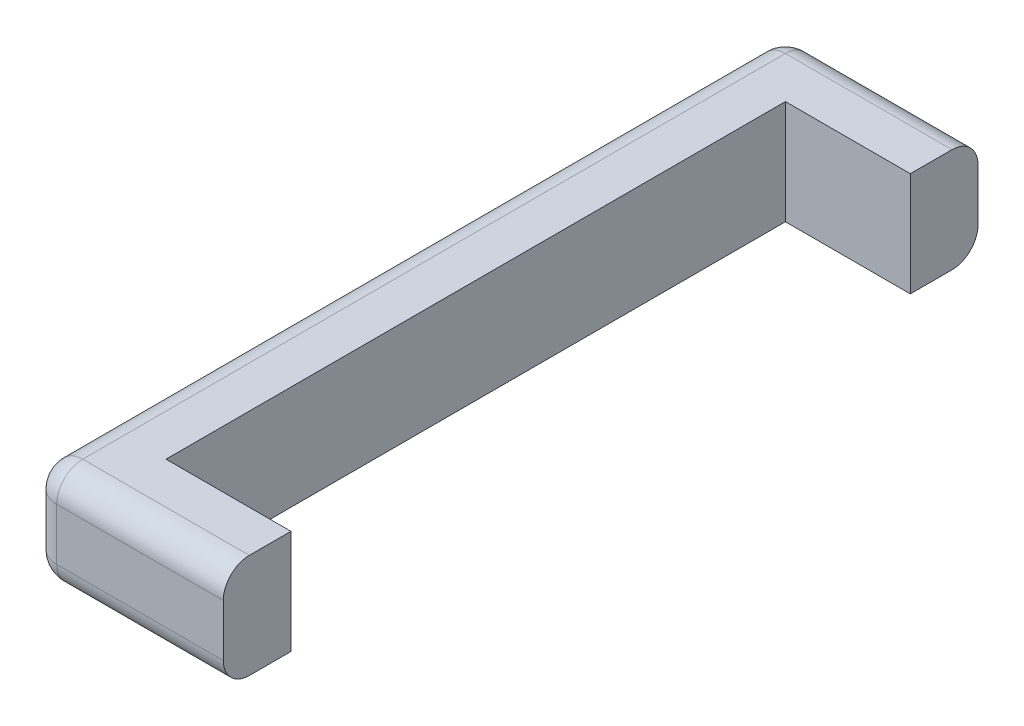
ISO-10303-21;
HEADER;
FILE_DESCRIPTION(('STEP AP214'),'2;1');
FILE_NAME('part.step','',(''),(''),'','','');
FILE_SCHEMA(('AUTOMOTIVE_DESIGN { 1 0 10303 214 1 1 1 1 }'));
ENDSEC;
DATA;
#1=APPLICATION_CONTEXT('core data for automotive mechanical design processes');
#2=APPLICATION_PROTOCOL_DEFINITION('international standard','automotive_design',2000,#1);
#3=PRODUCT_CONTEXT('',#1,'mechanical');
#4=PRODUCT('Part','Part','',(#3));
#5=PRODUCT_RELATED_PRODUCT_CATEGORY('part','',(#4));
#6=PRODUCT_DEFINITION_FORMATION('','',#4);
#7=PRODUCT_DEFINITION_CONTEXT('part definition',#1,'design');
#8=PRODUCT_DEFINITION('design','',#6,#7);
#9=PRODUCT_DEFINITION_SHAPE('','',#8);
#10=(LENGTH_UNIT() NAMED_UNIT(*) SI_UNIT(.MILLI.,.METRE.));
#11=(NAMED_UNIT(*) PLANE_ANGLE_UNIT() SI_UNIT($,.RADIAN.));
#12=(NAMED_UNIT(*) SI_UNIT($,.STERADIAN.) SOLID_ANGLE_UNIT());
#13=UNCERTAINTY_MEASURE_WITH_UNIT(LENGTH_MEASURE(1.E-05),#10,'distance_accuracy_value','');
#14=(GEOMETRIC_REPRESENTATION_CONTEXT(3) GLOBAL_UNCERTAINTY_ASSIGNED_CONTEXT((#13)) GLOBAL_UNIT_ASSIGNED_CONTEXT((#10,
#11,#12)) REPRESENTATION_CONTEXT('',''));
#15=CARTESIAN_POINT('',(0.,0.,0.));
#16=DIRECTION('',(0.,0.,1.));
#17=DIRECTION('',(1.,0.,0.));
#18=AXIS2_PLACEMENT_3D('',#15,#16,#17);
#19=CARTESIAN_POINT('',(0.,63.5,377.825));
#20=DIRECTION('',(0.,0.,1.));
#21=DIRECTION('',(1.,0.,0.));
#22=AXIS2_PLACEMENT_3D('',#19,#20,#21);
#23=PLANE('',#22);
#24=DIRECTION('',(-1.,0.,0.));
#25=VECTOR('',#24,1.);
#26=CARTESIAN_POINT('',(0.,-63.5,377.825));
#27=LINE('',#26,#25);
#28=CARTESIAN_POINT('',(152.4,-63.5,377.825));
#29=VERTEX_POINT('',#28);
#30=CARTESIAN_POINT('',(0.,-63.5,377.825));
#31=VERTEX_POINT('',#30);
#32=EDGE_CURVE('E162',#29,#31,#27,.T.);
#33=ORIENTED_EDGE('',*,*,#32,.T.);
#34=DIRECTION('',(0.,-1.,0.));
#35=VECTOR('',#34,1.);
#36=CARTESIAN_POINT('',(0.,63.5,377.825));
#37=LINE('',#36,#35);
#38=CARTESIAN_POINT('',(0.,63.5,377.825));
#39=VERTEX_POINT('',#38);
#40=EDGE_CURVE('E143',#39,#31,#37,.T.);
#41=ORIENTED_EDGE('',*,*,#40,.F.);
#42=DIRECTION('',(-1.,0.,0.));
#43=VECTOR('',#42,1.);
#44=CARTESIAN_POINT('',(0.,63.5,377.825));
#45=LINE('',#44,#43);
#46=CARTESIAN_POINT('',(152.4,63.5,377.825));
#47=VERTEX_POINT('',#46);
#48=EDGE_CURVE('E149',#47,#39,#45,.T.);
#49=ORIENTED_EDGE('',*,*,#48,.F.);
#50=DIRECTION('',(0.,-1.,0.));
#51=VECTOR('',#50,1.);
#52=CARTESIAN_POINT('',(152.4,63.5,377.825));
#53=LINE('',#52,#51);
#54=EDGE_CURVE('E235',#47,#29,#53,.T.);
#55=ORIENTED_EDGE('',*,*,#54,.T.);
#56=EDGE_LOOP('',(#33,#41,#49,#55));
#57=FACE_BOUND('',#56,.T.);
#58=ADVANCED_FACE('F34',(#57),#23,.F.);
#59=CARTESIAN_POINT('',(-1.39199478425084E-13,63.5,-377.825));
#60=DIRECTION('',(-1.,0.,0.));
#61=DIRECTION('',(0.,0.,1.));
#62=AXIS2_PLACEMENT_3D('',#59,#60,#61);
#63=PLANE('',#62);
#64=DIRECTION('',(0.,0.,-1.));
#65=VECTOR('',#64,1.);
#66=CARTESIAN_POINT('',(-1.39199478425084E-13,-63.5,-377.825));
#67=LINE('',#66,#65);
#68=CARTESIAN_POINT('',(-1.39199478425084E-13,-63.5,-377.825));
#69=VERTEX_POINT('',#68);
#70=EDGE_CURVE('E244',#31,#69,#67,.T.);
#71=ORIENTED_EDGE('',*,*,#70,.T.);
#72=DIRECTION('',(0.,-1.,0.));
#73=VECTOR('',#72,1.);
#74=CARTESIAN_POINT('',(-1.39199478425084E-13,63.5,-377.825));
#75=LINE('',#74,#73);
#76=CARTESIAN_POINT('',(-1.39199478425084E-13,63.5,-377.825));
#77=VERTEX_POINT('',#76);
#78=EDGE_CURVE('E146',#77,#69,#75,.T.);
#79=ORIENTED_EDGE('',*,*,#78,.F.);
#80=DIRECTION('',(0.,0.,-1.));
#81=VECTOR('',#80,1.);
#82=CARTESIAN_POINT('',(-1.39199478425084E-13,63.5,-377.825));
#83=LINE('',#82,#81);
#84=EDGE_CURVE('E139',#39,#77,#83,.T.);
#85=ORIENTED_EDGE('',*,*,#84,.F.);
#86=ORIENTED_EDGE('',*,*,#40,.T.);
#87=EDGE_LOOP('',(#71,#79,#85,#86));
#88=FACE_BOUND('',#87,.T.);
#89=ADVANCED_FACE('F141',(#88),#63,.F.);
#90=CARTESIAN_POINT('',(152.4,63.5,-377.825));
#91=DIRECTION('',(0.,0.,-1.));
#92=DIRECTION('',(-1.,0.,0.));
#93=AXIS2_PLACEMENT_3D('',#90,#91,#92);
#94=PLANE('',#93);
#95=DIRECTION('',(1.,0.,0.));
#96=VECTOR('',#95,1.);
#97=CARTESIAN_POINT('',(152.4,-63.5,-377.825));
#98=LINE('',#97,#96);
#99=CARTESIAN_POINT('',(152.4,-63.5,-377.825));
#100=VERTEX_POINT('',#99);
#101=EDGE_CURVE('E246',#69,#100,#98,.T.);
#102=ORIENTED_EDGE('',*,*,#101,.T.);
#103=DIRECTION('',(0.,-1.,0.));
#104=VECTOR('',#103,1.);
#105=CARTESIAN_POINT('',(152.4,63.5,-377.825));
#106=LINE('',#105,#104);
#107=CARTESIAN_POINT('',(152.4,63.5,-377.825));
#108=VERTEX_POINT('',#107);
#109=EDGE_CURVE('E167',#108,#100,#106,.T.);
#110=ORIENTED_EDGE('',*,*,#109,.F.);
#111=DIRECTION('',(1.,0.,0.));
#112=VECTOR('',#111,1.);
#113=CARTESIAN_POINT('',(152.4,63.5,-377.825));
#114=LINE('',#113,#112);
#115=EDGE_CURVE('E148',#77,#108,#114,.T.);
#116=ORIENTED_EDGE('',*,*,#115,.F.);
#117=ORIENTED_EDGE('',*,*,#78,.T.);
#118=EDGE_LOOP('',(#102,#110,#116,#117));
#119=FACE_BOUND('',#118,.T.);
#120=ADVANCED_FACE('F314',(#119),#94,.F.);
#121=CARTESIAN_POINT('',(152.4,63.5,-460.375));
#122=DIRECTION('',(-1.,0.,0.));
#123=DIRECTION('',(0.,0.,1.));
#124=AXIS2_PLACEMENT_3D('',#121,#122,#123);
#125=PLANE('',#124);
#126=DIRECTION('',(0.,0.,-1.));
#127=VECTOR('',#126,1.);
#128=CARTESIAN_POINT('',(152.4,-63.5,-460.375));
#129=LINE('',#128,#127);
#130=CARTESIAN_POINT('',(152.4,-63.5,-428.625));
#131=VERTEX_POINT('',#130);
#132=EDGE_CURVE('E248',#100,#131,#129,.T.);
#133=ORIENTED_EDGE('',*,*,#132,.T.);
#134=CARTESIAN_POINT('',(152.4,-31.75,-428.625));
#135=DIRECTION('',(-1.,0.,0.));
#136=DIRECTION('',(0.,0.,1.));
#137=AXIS2_PLACEMENT_3D('',#134,#135,#136);
#138=CIRCLE('',#137,31.75);
#139=CARTESIAN_POINT('',(152.4,-31.75,-460.375));
#140=VERTEX_POINT('',#139);
#141=EDGE_CURVE('E181',#131,#140,#138,.F.);
#142=ORIENTED_EDGE('',*,*,#141,.T.);
#143=DIRECTION('',(0.,-1.,0.));
#144=VECTOR('',#143,1.);
#145=CARTESIAN_POINT('',(152.4,63.5,-460.375));
#146=LINE('',#145,#144);
#147=CARTESIAN_POINT('',(152.4,31.75,-460.375));
#148=VERTEX_POINT('',#147);
#149=EDGE_CURVE('E265',#148,#140,#146,.T.);
#150=ORIENTED_EDGE('',*,*,#149,.F.);
#151=CARTESIAN_POINT('',(152.4,31.75,-428.625));
#152=DIRECTION('',(-1.,0.,0.));
#153=DIRECTION('',(0.,0.,1.));
#154=AXIS2_PLACEMENT_3D('',#151,#152,#153);
#155=CIRCLE('',#154,31.75);
#156=CARTESIAN_POINT('',(152.4,63.5,-428.625));
#157=VERTEX_POINT('',#156);
#158=EDGE_CURVE('E179',#148,#157,#155,.F.);
#159=ORIENTED_EDGE('',*,*,#158,.T.);
#160=DIRECTION('',(0.,0.,-1.));
#161=VECTOR('',#160,1.);
#162=CARTESIAN_POINT('',(152.4,63.5,-460.375));
#163=LINE('',#162,#161);
#164=EDGE_CURVE('E236',#108,#157,#163,.T.);
#165=ORIENTED_EDGE('',*,*,#164,.F.);
#166=ORIENTED_EDGE('',*,*,#109,.T.);
#167=EDGE_LOOP('',(#133,#142,#150,#159,#165,#166));
#168=FACE_BOUND('',#167,.T.);
#169=ADVANCED_FACE('F272',(#168),#125,.F.);
#170=CARTESIAN_POINT('',(-50.8000000000002,63.5,-460.375));
#171=DIRECTION('',(0.,0.,1.));
#172=DIRECTION('',(1.,0.,0.));
#173=AXIS2_PLACEMENT_3D('',#170,#171,#172);
#174=PLANE('',#173);
#175=ORIENTED_EDGE('',*,*,#149,.T.);
#176=DIRECTION('',(-1.,0.,0.));
#177=VECTOR('',#176,1.);
#178=CARTESIAN_POINT('',(-50.8000000000002,-31.75,-460.375));
#179=LINE('',#178,#177);
#180=CARTESIAN_POINT('',(-50.8000000000002,-31.75,-460.375));
#181=VERTEX_POINT('',#180);
#182=EDGE_CURVE('E165',#140,#181,#179,.T.);
#183=ORIENTED_EDGE('',*,*,#182,.T.);
#184=DIRECTION('',(0.,-1.,0.));
#185=VECTOR('',#184,1.);
#186=CARTESIAN_POINT('',(-50.8000000000002,63.5,-460.375));
#187=LINE('',#186,#185);
#188=CARTESIAN_POINT('',(-50.8000000000002,31.75,-460.375));
#189=VERTEX_POINT('',#188);
#190=EDGE_CURVE('E262',#189,#181,#187,.T.);
#191=ORIENTED_EDGE('',*,*,#190,.F.);
#192=DIRECTION('',(-1.,0.,0.));
#193=VECTOR('',#192,1.);
#194=CARTESIAN_POINT('',(-50.8000000000002,31.75,-460.375));
#195=LINE('',#194,#193);
#196=EDGE_CURVE('E163',#189,#148,#195,.F.);
#197=ORIENTED_EDGE('',*,*,#196,.T.);
#198=EDGE_LOOP('',(#175,#183,#191,#197));
#199=FACE_BOUND('',#198,.T.);
#200=ADVANCED_FACE('F292',(#199),#174,.F.);
#201=CARTESIAN_POINT('',(-50.8000000000002,63.5,-428.625));
#202=DIRECTION('',(0.,-1.,0.));
#203=DIRECTION('',(0.,0.,-1.));
#204=AXIS2_PLACEMENT_3D('',#201,#202,#203);
#205=CYLINDRICAL_SURFACE('',#204,31.75);
#206=ORIENTED_EDGE('',*,*,#190,.T.);
#207=CARTESIAN_POINT('',(-50.8000000000002,-31.75,-428.625));
#208=DIRECTION('',(0.,-1.,0.));
#209=DIRECTION('',(0.,0.,-1.));
#210=AXIS2_PLACEMENT_3D('',#207,#208,#209);
#211=CIRCLE('',#210,31.75);
#212=CARTESIAN_POINT('',(-82.5500000000002,-31.75,-428.625));
#213=VERTEX_POINT('',#212);
#214=EDGE_CURVE('E185',#181,#213,#211,.F.);
#215=ORIENTED_EDGE('',*,*,#214,.T.);
#216=DIRECTION('',(0.,-1.,0.));
#217=VECTOR('',#216,1.);
#218=CARTESIAN_POINT('',(-82.5500000000002,63.5,-428.625));
#219=LINE('',#218,#217);
#220=CARTESIAN_POINT('',(-82.5500000000002,31.75,-428.625));
#221=VERTEX_POINT('',#220);
#222=EDGE_CURVE('E259',#221,#213,#219,.T.);
#223=ORIENTED_EDGE('',*,*,#222,.F.);
#224=CARTESIAN_POINT('',(-50.8000000000002,31.75,-428.625));
#225=DIRECTION('',(0.,-1.,0.));
#226=DIRECTION('',(0.,0.,-1.));
#227=AXIS2_PLACEMENT_3D('',#224,#225,#226);
#228=CIRCLE('',#227,31.75);
#229=EDGE_CURVE('E183',#221,#189,#228,.T.);
#230=ORIENTED_EDGE('',*,*,#229,.T.);
#231=EDGE_LOOP('',(#206,#215,#223,#230));
#232=FACE_BOUND('',#231,.T.);
#233=ADVANCED_FACE('F294',(#232),#205,.T.);
#234=CARTESIAN_POINT('',(-82.5499999999999,63.5,428.625));
#235=DIRECTION('',(1.,0.,0.));
#236=DIRECTION('',(0.,0.,-1.));
#237=AXIS2_PLACEMENT_3D('',#234,#235,#236);
#238=PLANE('',#237);
#239=ORIENTED_EDGE('',*,*,#222,.T.);
#240=DIRECTION('',(0.,0.,1.));
#241=VECTOR('',#240,1.);
#242=CARTESIAN_POINT('',(-82.5499999999999,-31.75,428.625));
#243=LINE('',#242,#241);
#244=CARTESIAN_POINT('',(-82.5499999999999,-31.75,428.625));
#245=VERTEX_POINT('',#244);
#246=EDGE_CURVE('E11',#213,#245,#243,.T.);
#247=ORIENTED_EDGE('',*,*,#246,.T.);
#248=DIRECTION('',(0.,-1.,0.));
#249=VECTOR('',#248,1.);
#250=CARTESIAN_POINT('',(-82.5499999999999,63.5,428.625));
#251=LINE('',#250,#249);
#252=CARTESIAN_POINT('',(-82.5499999999999,31.75,428.625));
#253=VERTEX_POINT('',#252);
#254=EDGE_CURVE('E256',#253,#245,#251,.T.);
#255=ORIENTED_EDGE('',*,*,#254,.F.);
#256=DIRECTION('',(0.,0.,1.));
#257=VECTOR('',#256,1.);
#258=CARTESIAN_POINT('',(-82.5499999999999,31.75,428.625));
#259=LINE('',#258,#257);
#260=EDGE_CURVE('E43',#253,#221,#259,.F.);
#261=ORIENTED_EDGE('',*,*,#260,.T.);
#262=EDGE_LOOP('',(#239,#247,#255,#261));
#263=FACE_BOUND('',#262,.T.);
#264=ADVANCED_FACE('F351',(#263),#238,.F.);
#265=CARTESIAN_POINT('',(-50.7999999999999,63.5,428.625));
#266=DIRECTION('',(0.,-1.,0.));
#267=DIRECTION('',(0.,0.,-1.));
#268=AXIS2_PLACEMENT_3D('',#265,#266,#267);
#269=CYLINDRICAL_SURFACE('',#268,31.75);
#270=ORIENTED_EDGE('',*,*,#254,.T.);
#271=CARTESIAN_POINT('',(-50.7999999999999,-31.75,428.625));
#272=DIRECTION('',(0.,-1.,0.));
#273=DIRECTION('',(0.,0.,-1.));
#274=AXIS2_PLACEMENT_3D('',#271,#272,#273);
#275=CIRCLE('',#274,31.75);
#276=CARTESIAN_POINT('',(-50.7999999999999,-31.75,460.375));
#277=VERTEX_POINT('',#276);
#278=EDGE_CURVE('E197',#245,#277,#275,.F.);
#279=ORIENTED_EDGE('',*,*,#278,.T.);
#280=DIRECTION('',(0.,-1.,0.));
#281=VECTOR('',#280,1.);
#282=CARTESIAN_POINT('',(-50.7999999999999,63.5,460.375));
#283=LINE('',#282,#281);
#284=CARTESIAN_POINT('',(-50.7999999999999,31.75,460.375));
#285=VERTEX_POINT('',#284);
#286=EDGE_CURVE('E253',#285,#277,#283,.T.);
#287=ORIENTED_EDGE('',*,*,#286,.F.);
#288=CARTESIAN_POINT('',(-50.7999999999999,31.75,428.625));
#289=DIRECTION('',(0.,-1.,0.));
#290=DIRECTION('',(0.,0.,-1.));
#291=AXIS2_PLACEMENT_3D('',#288,#289,#290);
#292=CIRCLE('',#291,31.75);
#293=EDGE_CURVE('E195',#285,#253,#292,.T.);
#294=ORIENTED_EDGE('',*,*,#293,.T.);
#295=EDGE_LOOP('',(#270,#279,#287,#294));
#296=FACE_BOUND('',#295,.T.);
#297=ADVANCED_FACE('F354',(#296),#269,.T.);
#298=CARTESIAN_POINT('',(152.4,63.5,460.375));
#299=DIRECTION('',(0.,0.,-1.));
#300=DIRECTION('',(-1.,0.,0.));
#301=AXIS2_PLACEMENT_3D('',#298,#299,#300);
#302=PLANE('',#301);
#303=ORIENTED_EDGE('',*,*,#286,.T.);
#304=DIRECTION('',(1.,0.,0.));
#305=VECTOR('',#304,1.);
#306=CARTESIAN_POINT('',(152.4,-31.75,460.375));
#307=LINE('',#306,#305);
#308=CARTESIAN_POINT('',(152.4,-31.75,460.375));
#309=VERTEX_POINT('',#308);
#310=EDGE_CURVE('E189',#277,#309,#307,.T.);
#311=ORIENTED_EDGE('',*,*,#310,.T.);
#312=DIRECTION('',(0.,-1.,0.));
#313=VECTOR('',#312,1.);
#314=CARTESIAN_POINT('',(152.4,63.5,460.375));
#315=LINE('',#314,#313);
#316=CARTESIAN_POINT('',(152.4,31.75,460.375));
#317=VERTEX_POINT('',#316);
#318=EDGE_CURVE('E238',#317,#309,#315,.T.);
#319=ORIENTED_EDGE('',*,*,#318,.F.);
#320=DIRECTION('',(1.,0.,0.));
#321=VECTOR('',#320,1.);
#322=CARTESIAN_POINT('',(152.4,31.75,460.375));
#323=LINE('',#322,#321);
#324=EDGE_CURVE('E187',#317,#285,#323,.F.);
#325=ORIENTED_EDGE('',*,*,#324,.T.);
#326=EDGE_LOOP('',(#303,#311,#319,#325));
#327=FACE_BOUND('',#326,.T.);
#328=ADVANCED_FACE('F358',(#327),#302,.F.);
#329=CARTESIAN_POINT('',(152.4,63.5,377.825));
#330=DIRECTION('',(-1.,0.,0.));
#331=DIRECTION('',(0.,0.,1.));
#332=AXIS2_PLACEMENT_3D('',#329,#330,#331);
#333=PLANE('',#332);
#334=ORIENTED_EDGE('',*,*,#318,.T.);
#335=CARTESIAN_POINT('',(152.4,-31.75,428.625));
#336=DIRECTION('',(-1.,0.,0.));
#337=DIRECTION('',(0.,0.,1.));
#338=AXIS2_PLACEMENT_3D('',#335,#336,#337);
#339=CIRCLE('',#338,31.75);
#340=CARTESIAN_POINT('',(152.4,-63.5,428.625));
#341=VERTEX_POINT('',#340);
#342=EDGE_CURVE('E193',#309,#341,#339,.F.);
#343=ORIENTED_EDGE('',*,*,#342,.T.);
#344=DIRECTION('',(0.,0.,-1.));
#345=VECTOR('',#344,1.);
#346=CARTESIAN_POINT('',(152.4,-63.5,377.825));
#347=LINE('',#346,#345);
#348=EDGE_CURVE('E159',#341,#29,#347,.T.);
#349=ORIENTED_EDGE('',*,*,#348,.T.);
#350=ORIENTED_EDGE('',*,*,#54,.F.);
#351=DIRECTION('',(0.,0.,-1.));
#352=VECTOR('',#351,1.);
#353=CARTESIAN_POINT('',(152.4,63.5,377.825));
#354=LINE('',#353,#352);
#355=CARTESIAN_POINT('',(152.4,63.5,428.625));
#356=VERTEX_POINT('',#355);
#357=EDGE_CURVE('E155',#356,#47,#354,.T.);
#358=ORIENTED_EDGE('',*,*,#357,.F.);
#359=CARTESIAN_POINT('',(152.4,31.75,428.625));
#360=DIRECTION('',(-1.,0.,0.));
#361=DIRECTION('',(0.,0.,1.));
#362=AXIS2_PLACEMENT_3D('',#359,#360,#361);
#363=CIRCLE('',#362,31.75);
#364=EDGE_CURVE('E191',#356,#317,#363,.F.);
#365=ORIENTED_EDGE('',*,*,#364,.T.);
#366=EDGE_LOOP('',(#334,#343,#349,#350,#358,#365));
#367=FACE_BOUND('',#366,.T.);
#368=ADVANCED_FACE('F233',(#367),#333,.F.);
#369=CARTESIAN_POINT('',(-50.7999999999999,63.5,428.625));
#370=DIRECTION('',(0.,-1.,0.));
#371=DIRECTION('',(0.,0.,-1.));
#372=AXIS2_PLACEMENT_3D('',#369,#370,#371);
#373=PLANE('',#372);
#374=ORIENTED_EDGE('',*,*,#164,.T.);
#375=DIRECTION('',(-1.,0.,0.));
#376=VECTOR('',#375,1.);
#377=CARTESIAN_POINT('',(-50.7999999999999,63.5,-428.625));
#378=LINE('',#377,#376);
#379=CARTESIAN_POINT('',(-50.8000000000002,63.5,-428.625));
#380=VERTEX_POINT('',#379);
#381=EDGE_CURVE('E202',#157,#380,#378,.T.);
#382=ORIENTED_EDGE('',*,*,#381,.T.);
#383=DIRECTION('',(0.,0.,1.));
#384=VECTOR('',#383,1.);
#385=CARTESIAN_POINT('',(-50.7999999999999,63.5,428.625));
#386=LINE('',#385,#384);
#387=CARTESIAN_POINT('',(-50.7999999999999,63.5,428.625));
#388=VERTEX_POINT('',#387);
#389=EDGE_CURVE('E51',#380,#388,#386,.T.);
#390=ORIENTED_EDGE('',*,*,#389,.T.);
#391=DIRECTION('',(1.,0.,0.));
#392=VECTOR('',#391,1.);
#393=CARTESIAN_POINT('',(-50.7999999999999,63.5,428.625));
#394=LINE('',#393,#392);
#395=EDGE_CURVE('E200',#388,#356,#394,.T.);
#396=ORIENTED_EDGE('',*,*,#395,.T.);
#397=ORIENTED_EDGE('',*,*,#357,.T.);
#398=ORIENTED_EDGE('',*,*,#48,.T.);
#399=ORIENTED_EDGE('',*,*,#84,.T.);
#400=ORIENTED_EDGE('',*,*,#115,.T.);
#401=EDGE_LOOP('',(#374,#382,#390,#396,#397,#398,#399,#400));
#402=FACE_BOUND('',#401,.T.);
#403=ADVANCED_FACE('F153',(#402),#373,.F.);
#404=CARTESIAN_POINT('',(-50.7999999999999,-63.5,428.625));
#405=DIRECTION('',(0.,-1.,0.));
#406=DIRECTION('',(0.,0.,-1.));
#407=AXIS2_PLACEMENT_3D('',#404,#405,#406);
#408=PLANE('',#407);
#409=DIRECTION('',(0.,0.,1.));
#410=VECTOR('',#409,1.);
#411=CARTESIAN_POINT('',(-50.8000000000002,-63.5,-428.625));
#412=LINE('',#411,#410);
#413=CARTESIAN_POINT('',(-50.7999999999999,-63.5,428.625));
#414=VERTEX_POINT('',#413);
#415=CARTESIAN_POINT('',(-50.8000000000002,-63.5,-428.625));
#416=VERTEX_POINT('',#415);
#417=EDGE_CURVE('E173',#414,#416,#412,.F.);
#418=ORIENTED_EDGE('',*,*,#417,.T.);
#419=DIRECTION('',(-1.,0.,0.));
#420=VECTOR('',#419,1.);
#421=CARTESIAN_POINT('',(152.4,-63.5,-428.625));
#422=LINE('',#421,#420);
#423=EDGE_CURVE('E177',#416,#131,#422,.F.);
#424=ORIENTED_EDGE('',*,*,#423,.T.);
#425=ORIENTED_EDGE('',*,*,#132,.F.);
#426=ORIENTED_EDGE('',*,*,#101,.F.);
#427=ORIENTED_EDGE('',*,*,#70,.F.);
#428=ORIENTED_EDGE('',*,*,#32,.F.);
#429=ORIENTED_EDGE('',*,*,#348,.F.);
#430=DIRECTION('',(1.,0.,0.));
#431=VECTOR('',#430,1.);
#432=CARTESIAN_POINT('',(-50.7999999999999,-63.5,428.625));
#433=LINE('',#432,#431);
#434=EDGE_CURVE('E175',#341,#414,#433,.F.);
#435=ORIENTED_EDGE('',*,*,#434,.T.);
#436=EDGE_LOOP('',(#418,#424,#425,#426,#427,#428,#429,#435));
#437=FACE_BOUND('',#436,.T.);
#438=ADVANCED_FACE('F277',(#437),#408,.T.);
#439=CARTESIAN_POINT('',(152.4,-31.75,428.625));
#440=DIRECTION('',(-1.,0.,0.));
#441=DIRECTION('',(0.,0.,1.));
#442=AXIS2_PLACEMENT_3D('',#439,#440,#441);
#443=CYLINDRICAL_SURFACE('',#442,31.75);
#444=ORIENTED_EDGE('',*,*,#342,.F.);
#445=ORIENTED_EDGE('',*,*,#310,.F.);
#446=CARTESIAN_POINT('',(-50.7999999999999,-31.75,428.625));
#447=DIRECTION('',(-1.,0.,0.));
#448=DIRECTION('',(0.,0.,1.));
#449=AXIS2_PLACEMENT_3D('',#446,#447,#448);
#450=CIRCLE('',#449,31.75);
#451=EDGE_CURVE('E213',#414,#277,#450,.T.);
#452=ORIENTED_EDGE('',*,*,#451,.F.);
#453=ORIENTED_EDGE('',*,*,#434,.F.);
#454=EDGE_LOOP('',(#444,#445,#452,#453));
#455=FACE_BOUND('',#454,.T.);
#456=ADVANCED_FACE('F328',(#455),#443,.T.);
#457=CARTESIAN_POINT('',(-50.7999999999999,-31.75,428.625));
#458=DIRECTION('',(0.,-1.,0.));
#459=DIRECTION('',(0.,0.,-1.));
#460=AXIS2_PLACEMENT_3D('',#457,#458,#459);
#461=SPHERICAL_SURFACE('',#460,31.75);
#462=ORIENTED_EDGE('',*,*,#451,.T.);
#463=ORIENTED_EDGE('',*,*,#278,.F.);
#464=CARTESIAN_POINT('',(-50.7999999999999,-31.75,428.625));
#465=DIRECTION('',(0.,0.,-1.));
#466=DIRECTION('',(-1.,0.,0.));
#467=AXIS2_PLACEMENT_3D('',#464,#465,#466);
#468=CIRCLE('',#467,31.75);
#469=EDGE_CURVE('E210',#414,#245,#468,.T.);
#470=ORIENTED_EDGE('',*,*,#469,.F.);
#471=EDGE_LOOP('',(#462,#463,#470));
#472=FACE_BOUND('',#471,.T.);
#473=ADVANCED_FACE('F325',(#472),#461,.T.);
#474=CARTESIAN_POINT('',(-50.7999999999999,-31.75,428.625));
#475=DIRECTION('',(0.,0.,-1.));
#476=DIRECTION('',(-1.,0.,0.));
#477=AXIS2_PLACEMENT_3D('',#474,#475,#476);
#478=CYLINDRICAL_SURFACE('',#477,31.75);
#479=ORIENTED_EDGE('',*,*,#469,.T.);
#480=ORIENTED_EDGE('',*,*,#246,.F.);
#481=CARTESIAN_POINT('',(-50.8000000000002,-31.75,-428.625));
#482=DIRECTION('',(0.,0.,-1.));
#483=DIRECTION('',(-1.,0.,0.));
#484=AXIS2_PLACEMENT_3D('',#481,#482,#483);
#485=CIRCLE('',#484,31.75);
#486=EDGE_CURVE('E207',#416,#213,#485,.T.);
#487=ORIENTED_EDGE('',*,*,#486,.F.);
#488=ORIENTED_EDGE('',*,*,#417,.F.);
#489=EDGE_LOOP('',(#479,#480,#487,#488));
#490=FACE_BOUND('',#489,.T.);
#491=ADVANCED_FACE('F322',(#490),#478,.T.);
#492=CARTESIAN_POINT('',(-50.8000000000002,-31.75,-428.625));
#493=DIRECTION('',(0.,-1.,0.));
#494=DIRECTION('',(0.,0.,-1.));
#495=AXIS2_PLACEMENT_3D('',#492,#493,#494);
#496=SPHERICAL_SURFACE('',#495,31.75);
#497=ORIENTED_EDGE('',*,*,#486,.T.);
#498=ORIENTED_EDGE('',*,*,#214,.F.);
#499=CARTESIAN_POINT('',(-50.8000000000002,-31.75,-428.625));
#500=DIRECTION('',(1.,0.,0.));
#501=DIRECTION('',(0.,0.,-1.));
#502=AXIS2_PLACEMENT_3D('',#499,#500,#501);
#503=CIRCLE('',#502,31.75);
#504=EDGE_CURVE('E205',#416,#181,#503,.T.);
#505=ORIENTED_EDGE('',*,*,#504,.F.);
#506=EDGE_LOOP('',(#497,#498,#505));
#507=FACE_BOUND('',#506,.T.);
#508=ADVANCED_FACE('F287',(#507),#496,.T.);
#509=CARTESIAN_POINT('',(-50.8000000000002,-31.75,-428.625));
#510=DIRECTION('',(1.,0.,0.));
#511=DIRECTION('',(0.,0.,-1.));
#512=AXIS2_PLACEMENT_3D('',#509,#510,#511);
#513=CYLINDRICAL_SURFACE('',#512,31.75);
#514=ORIENTED_EDGE('',*,*,#141,.F.);
#515=ORIENTED_EDGE('',*,*,#423,.F.);
#516=ORIENTED_EDGE('',*,*,#504,.T.);
#517=ORIENTED_EDGE('',*,*,#182,.F.);
#518=EDGE_LOOP('',(#514,#515,#516,#517));
#519=FACE_BOUND('',#518,.T.);
#520=ADVANCED_FACE('F283',(#519),#513,.T.);
#521=CARTESIAN_POINT('',(-50.7999999999999,31.75,428.625));
#522=DIRECTION('',(1.,0.,0.));
#523=DIRECTION('',(0.,0.,-1.));
#524=AXIS2_PLACEMENT_3D('',#521,#522,#523);
#525=CYLINDRICAL_SURFACE('',#524,31.75);
#526=CARTESIAN_POINT('',(-50.7999999999999,31.75,428.625));
#527=DIRECTION('',(-1.,0.,0.));
#528=DIRECTION('',(0.,0.,1.));
#529=AXIS2_PLACEMENT_3D('',#526,#527,#528);
#530=CIRCLE('',#529,31.75);
#531=EDGE_CURVE('E38',#285,#388,#530,.T.);
#532=ORIENTED_EDGE('',*,*,#531,.F.);
#533=ORIENTED_EDGE('',*,*,#324,.F.);
#534=ORIENTED_EDGE('',*,*,#364,.F.);
#535=ORIENTED_EDGE('',*,*,#395,.F.);
#536=EDGE_LOOP('',(#532,#533,#534,#535));
#537=FACE_BOUND('',#536,.T.);
#538=ADVANCED_FACE('F36',(#537),#525,.T.);
#539=CARTESIAN_POINT('',(-50.7999999999999,31.75,428.625));
#540=DIRECTION('',(0.,-1.,0.));
#541=DIRECTION('',(0.,0.,-1.));
#542=AXIS2_PLACEMENT_3D('',#539,#540,#541);
#543=SPHERICAL_SURFACE('',#542,31.75);
#544=ORIENTED_EDGE('',*,*,#293,.F.);
#545=ORIENTED_EDGE('',*,*,#531,.T.);
#546=CARTESIAN_POINT('',(-50.7999999999999,31.75,428.625));
#547=DIRECTION('',(0.,0.,-1.));
#548=DIRECTION('',(-1.,0.,0.));
#549=AXIS2_PLACEMENT_3D('',#546,#547,#548);
#550=CIRCLE('',#549,31.75);
#551=EDGE_CURVE('E218',#253,#388,#550,.T.);
#552=ORIENTED_EDGE('',*,*,#551,.F.);
#553=EDGE_LOOP('',(#544,#545,#552));
#554=FACE_BOUND('',#553,.T.);
#555=ADVANCED_FACE('F227',(#554),#543,.T.);
#556=CARTESIAN_POINT('',(-50.7999999999999,31.75,428.625));
#557=DIRECTION('',(0.,0.,1.));
#558=DIRECTION('',(1.,0.,0.));
#559=AXIS2_PLACEMENT_3D('',#556,#557,#558);
#560=CYLINDRICAL_SURFACE('',#559,31.75);
#561=CARTESIAN_POINT('',(-50.8000000000002,31.75,-428.625));
#562=DIRECTION('',(0.,0.,-1.));
#563=DIRECTION('',(-1.,0.,0.));
#564=AXIS2_PLACEMENT_3D('',#561,#562,#563);
#565=CIRCLE('',#564,31.75);
#566=EDGE_CURVE('E217',#221,#380,#565,.T.);
#567=ORIENTED_EDGE('',*,*,#566,.F.);
#568=ORIENTED_EDGE('',*,*,#260,.F.);
#569=ORIENTED_EDGE('',*,*,#551,.T.);
#570=ORIENTED_EDGE('',*,*,#389,.F.);
#571=EDGE_LOOP('',(#567,#568,#569,#570));
#572=FACE_BOUND('',#571,.T.);
#573=ADVANCED_FACE('F299',(#572),#560,.T.);
#574=CARTESIAN_POINT('',(-50.8000000000002,31.75,-428.625));
#575=DIRECTION('',(0.,-1.,0.));
#576=DIRECTION('',(0.,0.,-1.));
#577=AXIS2_PLACEMENT_3D('',#574,#575,#576);
#578=SPHERICAL_SURFACE('',#577,31.75);
#579=ORIENTED_EDGE('',*,*,#229,.F.);
#580=ORIENTED_EDGE('',*,*,#566,.T.);
#581=CARTESIAN_POINT('',(-50.8000000000002,31.75,-428.625));
#582=DIRECTION('',(1.,0.,0.));
#583=DIRECTION('',(0.,0.,-1.));
#584=AXIS2_PLACEMENT_3D('',#581,#582,#583);
#585=CIRCLE('',#584,31.75);
#586=EDGE_CURVE('E59',#189,#380,#585,.T.);
#587=ORIENTED_EDGE('',*,*,#586,.F.);
#588=EDGE_LOOP('',(#579,#580,#587));
#589=FACE_BOUND('',#588,.T.);
#590=ADVANCED_FACE('F298',(#589),#578,.T.);
#591=CARTESIAN_POINT('',(-50.7999999999999,31.75,-428.625));
#592=DIRECTION('',(-1.,0.,0.));
#593=DIRECTION('',(0.,0.,1.));
#594=AXIS2_PLACEMENT_3D('',#591,#592,#593);
#595=CYLINDRICAL_SURFACE('',#594,31.75);
#596=ORIENTED_EDGE('',*,*,#158,.F.);
#597=ORIENTED_EDGE('',*,*,#196,.F.);
#598=ORIENTED_EDGE('',*,*,#586,.T.);
#599=ORIENTED_EDGE('',*,*,#381,.F.);
#600=EDGE_LOOP('',(#596,#597,#598,#599));
#601=FACE_BOUND('',#600,.T.);
#602=ADVANCED_FACE('F301',(#601),#595,.T.);
#603=CLOSED_SHELL('',(#58,#89,#120,#169,#200,#233,#264,#297,#328,#368,#403,#438,#456,#473,#491,
#508,#520,#538,#555,#573,#590,#602));
#604=MANIFOLD_SOLID_BREP('B2',#603);
#605=ADVANCED_BREP_SHAPE_REPRESENTATION('',(#18,#604),#14);
#606=SHAPE_DEFINITION_REPRESENTATION(#9,#605);
ENDSEC;
END-ISO-10303-21;
